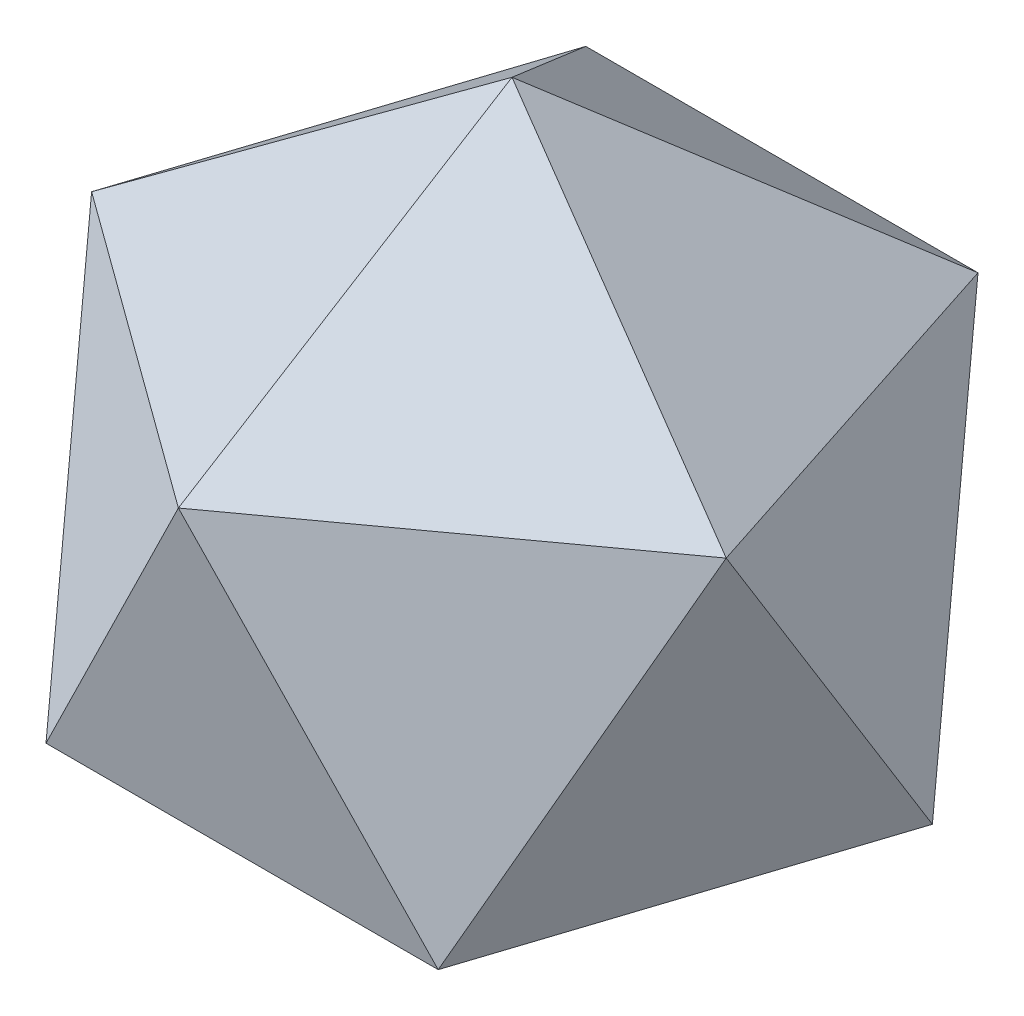
ISO-10303-21;
HEADER;
FILE_DESCRIPTION(('STEP AP214'),'2;1');
FILE_NAME('part.step','',(''),(''),'','','');
FILE_SCHEMA(('AUTOMOTIVE_DESIGN { 1 0 10303 214 1 1 1 1 }'));
ENDSEC;
DATA;
#1=APPLICATION_CONTEXT('core data for automotive mechanical design processes');
#2=APPLICATION_PROTOCOL_DEFINITION('international standard','automotive_design',2000,#1);
#3=PRODUCT_CONTEXT('',#1,'mechanical');
#4=PRODUCT('Part','Part','',(#3));
#5=PRODUCT_RELATED_PRODUCT_CATEGORY('part','',(#4));
#6=PRODUCT_DEFINITION_FORMATION('','',#4);
#7=PRODUCT_DEFINITION_CONTEXT('part definition',#1,'design');
#8=PRODUCT_DEFINITION('design','',#6,#7);
#9=PRODUCT_DEFINITION_SHAPE('','',#8);
#10=(LENGTH_UNIT() NAMED_UNIT(*) SI_UNIT(.MILLI.,.METRE.));
#11=(NAMED_UNIT(*) PLANE_ANGLE_UNIT() SI_UNIT($,.RADIAN.));
#12=(NAMED_UNIT(*) SI_UNIT($,.STERADIAN.) SOLID_ANGLE_UNIT());
#13=UNCERTAINTY_MEASURE_WITH_UNIT(LENGTH_MEASURE(1.E-05),#10,'distance_accuracy_value','');
#14=(GEOMETRIC_REPRESENTATION_CONTEXT(3) GLOBAL_UNCERTAINTY_ASSIGNED_CONTEXT((#13)) GLOBAL_UNIT_ASSIGNED_CONTEXT((#10,
#11,#12)) REPRESENTATION_CONTEXT('',''));
#15=CARTESIAN_POINT('',(0.,0.,0.));
#16=DIRECTION('',(0.,0.,1.));
#17=DIRECTION('',(1.,0.,0.));
#18=AXIS2_PLACEMENT_3D('',#15,#16,#17);
#19=CARTESIAN_POINT('',(-10.2589451239174,-3.33333333333333,-14.1202265916661));
#20=DIRECTION('',(0.577350269189618,0.187592474085079,0.794654472291772));
#21=DIRECTION('',(0.809016994374954,0.,-0.587785252292465));
#22=AXIS2_PLACEMENT_3D('',#19,#20,#21);
#23=PLANE('',#22);
#24=DIRECTION('',(0.809016994374954,0.,-0.587785252292465));
#25=VECTOR('',#24,1.);
#26=CARTESIAN_POINT('',(2.28983498828939E-13,0.,-22.3606797749979));
#27=LINE('',#26,#25);
#28=CARTESIAN_POINT('',(-21.266270208801,0.,-6.90983005625071));
#29=VERTEX_POINT('',#28);
#30=CARTESIAN_POINT('',(0.,0.,-22.3606797749979));
#31=VERTEX_POINT('',#30);
#32=EDGE_CURVE('E138',#29,#31,#27,.T.);
#33=ORIENTED_EDGE('',*,*,#32,.F.);
#34=DIRECTION('',(0.309016994374952,0.85065080835204,-0.425325404176017));
#35=VECTOR('',#34,1.);
#36=CARTESIAN_POINT('',(-13.1432778029782,22.3606797749979,-18.0901699437496));
#37=LINE('',#36,#35);
#38=CARTESIAN_POINT('',(-13.1432778029782,22.3606797749979,-18.0901699437496));
#39=VERTEX_POINT('',#38);
#40=EDGE_CURVE('E145',#29,#39,#37,.T.);
#41=ORIENTED_EDGE('',*,*,#40,.T.);
#42=DIRECTION('',(0.500000000000002,-0.85065080835204,-0.162459848116448));
#43=VECTOR('',#42,1.);
#44=CARTESIAN_POINT('',(-13.1432778029781,22.3606797749979,-18.0901699437496));
#45=LINE('',#44,#43);
#46=EDGE_CURVE('E156',#39,#31,#45,.T.);
#47=ORIENTED_EDGE('',*,*,#46,.T.);
#48=EDGE_LOOP('',(#33,#41,#47));
#49=FACE_BOUND('',#48,.T.);
#50=ADVANCED_FACE('F85',(#49),#23,.F.);
#51=CARTESIAN_POINT('',(-3.91856834861644,-8.72677996249966,-5.39344662916636));
#52=DIRECTION('',(0.356822089773085,0.794654472291766,0.491123473188427));
#53=DIRECTION('',(0.809016994374944,-0.525731112119134,0.262865556059576));
#54=AXIS2_PLACEMENT_3D('',#51,#52,#53);
#55=PLANE('',#54);
#56=DIRECTION('',(0.809016994374945,-0.525731112119134,0.262865556059573));
#57=VECTOR('',#56,1.);
#58=CARTESIAN_POINT('',(-21.266270208801,0.,-6.90983005625069));
#59=LINE('',#58,#57);
#60=CARTESIAN_POINT('',(0.,-13.8196601125011,0.));
#61=VERTEX_POINT('',#60);
#62=EDGE_CURVE('E155',#29,#61,#59,.T.);
#63=ORIENTED_EDGE('',*,*,#62,.F.);
#64=ORIENTED_EDGE('',*,*,#32,.T.);
#65=DIRECTION('',(0.,0.525731112119134,-0.85065080835204));
#66=VECTOR('',#65,1.);
#67=CARTESIAN_POINT('',(0.,0.,-22.3606797749979));
#68=LINE('',#67,#66);
#69=EDGE_CURVE('E161',#61,#31,#68,.T.);
#70=ORIENTED_EDGE('',*,*,#69,.F.);
#71=EDGE_LOOP('',(#63,#64,#70));
#72=FACE_BOUND('',#71,.T.);
#73=ADVANCED_FACE('F160',(#72),#55,.F.);
#74=CARTESIAN_POINT('',(2.51534904016637E-13,4.12022659166599,-21.5737865166653));
#75=DIRECTION('',(0.,0.187592474085081,-0.982246946376846));
#76=DIRECTION('',(-1.,0.,0.));
#77=AXIS2_PLACEMENT_3D('',#74,#75,#76);
#78=PLANE('',#77);
#79=DIRECTION('',(-0.5,-0.85065080835204,-0.162459848116453));
#80=VECTOR('',#79,1.);
#81=CARTESIAN_POINT('',(13.1432778029783,22.3606797749979,-18.0901699437495));
#82=LINE('',#81,#80);
#83=CARTESIAN_POINT('',(13.1432778029784,22.3606797749979,-18.0901699437495));
#84=VERTEX_POINT('',#83);
#85=EDGE_CURVE('E272',#84,#31,#82,.T.);
#86=ORIENTED_EDGE('',*,*,#85,.T.);
#87=ORIENTED_EDGE('',*,*,#46,.F.);
#88=DIRECTION('',(-1.,0.,0.));
#89=VECTOR('',#88,1.);
#90=CARTESIAN_POINT('',(13.1432778029785,22.3606797749979,-18.0901699437493));
#91=LINE('',#90,#89);
#92=EDGE_CURVE('E259',#84,#39,#91,.T.);
#93=ORIENTED_EDGE('',*,*,#92,.F.);
#94=EDGE_LOOP('',(#86,#87,#93));
#95=FACE_BOUND('',#94,.T.);
#96=ADVANCED_FACE('F419',(#95),#78,.T.);
#97=CARTESIAN_POINT('',(-20.517890247835,4.12022659166599,-6.66666666666686));
#98=DIRECTION('',(-0.934172358962713,0.187592474085081,-0.303530999103352));
#99=DIRECTION('',(-0.309016994374956,0.,0.951056516295151));
#100=AXIS2_PLACEMENT_3D('',#97,#98,#99);
#101=PLANE('',#100);
#102=ORIENTED_EDGE('',*,*,#40,.F.);
#103=DIRECTION('',(0.,0.85065080835204,0.525731112119133));
#104=VECTOR('',#103,1.);
#105=CARTESIAN_POINT('',(-21.2662702088011,22.3606797749979,6.90983005625035));
#106=LINE('',#105,#104);
#107=CARTESIAN_POINT('',(-21.266270208801,22.3606797749979,6.90983005625039));
#108=VERTEX_POINT('',#107);
#109=EDGE_CURVE('E148',#29,#108,#106,.T.);
#110=ORIENTED_EDGE('',*,*,#109,.T.);
#111=DIRECTION('',(-0.309016994374956,0.,0.951056516295151));
#112=VECTOR('',#111,1.);
#113=CARTESIAN_POINT('',(-13.1432778029782,22.3606797749979,-18.0901699437496));
#114=LINE('',#113,#112);
#115=EDGE_CURVE('E150',#39,#108,#114,.T.);
#116=ORIENTED_EDGE('',*,*,#115,.F.);
#117=EDGE_LOOP('',(#102,#110,#116));
#118=FACE_BOUND('',#117,.T.);
#119=ADVANCED_FACE('F146',(#118),#101,.T.);
#120=CARTESIAN_POINT('',(-6.34037677530105,-8.72677996249966,2.06011329583294));
#121=DIRECTION('',(0.577350269189627,0.794654472291766,-0.187592474085075));
#122=DIRECTION('',(0.500000000000006,-0.525731112119134,-0.688190960235582));
#123=AXIS2_PLACEMENT_3D('',#120,#121,#122);
#124=PLANE('',#123);
#125=DIRECTION('',(0.500000000000003,-0.525731112119133,-0.688190960235584));
#126=VECTOR('',#125,1.);
#127=CARTESIAN_POINT('',(-13.1432778029784,0.,18.0901699437494));
#128=LINE('',#127,#126);
#129=CARTESIAN_POINT('',(-13.1432778029784,0.,18.0901699437494));
#130=VERTEX_POINT('',#129);
#131=EDGE_CURVE('E177',#130,#61,#128,.T.);
#132=ORIENTED_EDGE('',*,*,#131,.F.);
#133=DIRECTION('',(-0.30901699437494,0.,-0.951056516295156));
#134=VECTOR('',#133,1.);
#135=CARTESIAN_POINT('',(-21.266270208801,0.,-6.9098300562507));
#136=LINE('',#135,#134);
#137=EDGE_CURVE('E168',#130,#29,#136,.T.);
#138=ORIENTED_EDGE('',*,*,#137,.T.);
#139=ORIENTED_EDGE('',*,*,#62,.T.);
#140=EDGE_LOOP('',(#132,#138,#139));
#141=FACE_BOUND('',#140,.T.);
#142=ADVANCED_FACE('F176',(#141),#124,.F.);
#143=CARTESIAN_POINT('',(-16.5993218992186,-3.33333333333333,5.39344662916619));
#144=DIRECTION('',(0.934172358962718,0.18759247408508,-0.303530999103336));
#145=DIRECTION('',(-0.30901699437494,0.,-0.951056516295156));
#146=AXIS2_PLACEMENT_3D('',#143,#144,#145);
#147=PLANE('',#146);
#148=ORIENTED_EDGE('',*,*,#137,.F.);
#149=DIRECTION('',(-0.309016994374945,0.85065080835204,-0.425325404176022));
#150=VECTOR('',#149,1.);
#151=CARTESIAN_POINT('',(-21.266270208801,22.3606797749979,6.90983005625043));
#152=LINE('',#151,#150);
#153=EDGE_CURVE('E173',#130,#108,#152,.T.);
#154=ORIENTED_EDGE('',*,*,#153,.T.);
#155=ORIENTED_EDGE('',*,*,#109,.F.);
#156=EDGE_LOOP('',(#148,#154,#155));
#157=FACE_BOUND('',#156,.T.);
#158=ADVANCED_FACE('F171',(#157),#147,.F.);
#159=CARTESIAN_POINT('',(3.91856834861649,-8.72677996249966,-5.39344662916633));
#160=DIRECTION('',(-0.356822089773089,0.794654472291766,0.491123473188424));
#161=DIRECTION('',(0.,-0.525731112119134,0.85065080835204));
#162=AXIS2_PLACEMENT_3D('',#159,#160,#161);
#163=PLANE('',#162);
#164=ORIENTED_EDGE('',*,*,#69,.T.);
#165=DIRECTION('',(0.809016994374948,0.,0.587785252292472));
#166=VECTOR('',#165,1.);
#167=CARTESIAN_POINT('',(21.266270208801,0.,-6.90983005625055));
#168=LINE('',#167,#166);
#169=CARTESIAN_POINT('',(21.266270208801,0.,-6.90983005625051));
#170=VERTEX_POINT('',#169);
#171=EDGE_CURVE('E210',#31,#170,#168,.T.);
#172=ORIENTED_EDGE('',*,*,#171,.T.);
#173=DIRECTION('',(0.809016994374948,0.525731112119134,-0.262865556059565));
#174=VECTOR('',#173,1.);
#175=CARTESIAN_POINT('',(21.266270208801,0.,-6.90983005625049));
#176=LINE('',#175,#174);
#177=EDGE_CURVE('E312',#61,#170,#176,.T.);
#178=ORIENTED_EDGE('',*,*,#177,.F.);
#179=EDGE_LOOP('',(#164,#172,#178));
#180=FACE_BOUND('',#179,.T.);
#181=ADVANCED_FACE('F532',(#180),#163,.F.);
#182=CARTESIAN_POINT('',(10.2589451239175,-3.33333333333333,-14.120226591666));
#183=DIRECTION('',(-0.577350269189625,0.18759247408508,0.794654472291767));
#184=DIRECTION('',(0.809016994374948,0.,0.587785252292472));
#185=AXIS2_PLACEMENT_3D('',#182,#183,#184);
#186=PLANE('',#185);
#187=ORIENTED_EDGE('',*,*,#171,.F.);
#188=ORIENTED_EDGE('',*,*,#85,.F.);
#189=DIRECTION('',(0.309016994374948,-0.85065080835204,0.42532540417602));
#190=VECTOR('',#189,1.);
#191=CARTESIAN_POINT('',(13.1432778029784,22.3606797749979,-18.0901699437495));
#192=LINE('',#191,#190);
#193=EDGE_CURVE('E318',#84,#170,#192,.T.);
#194=ORIENTED_EDGE('',*,*,#193,.T.);
#195=EDGE_LOOP('',(#187,#188,#194));
#196=FACE_BOUND('',#195,.T.);
#197=ADVANCED_FACE('F523',(#196),#186,.F.);
#198=CARTESIAN_POINT('',(2.02962646689286E-13,22.8470065541656,-17.4535599249993));
#199=DIRECTION('',(0.,0.794654472291766,-0.607061998206687));
#200=DIRECTION('',(-0.250000000000009,0.587785252292474,0.76942088429381));
#201=AXIS2_PLACEMENT_3D('',#198,#199,#200);
#202=PLANE('',#201);
#203=ORIENTED_EDGE('',*,*,#92,.T.);
#204=DIRECTION('',(-0.499999999999994,-0.525731112119134,-0.688190960235591));
#205=VECTOR('',#204,1.);
#206=CARTESIAN_POINT('',(0.,36.180339887499,0.));
#207=LINE('',#206,#205);
#208=CARTESIAN_POINT('',(0.,36.180339887499,0.));
#209=VERTEX_POINT('',#208);
#210=EDGE_CURVE('E250',#209,#39,#207,.T.);
#211=ORIENTED_EDGE('',*,*,#210,.F.);
#212=DIRECTION('',(-0.499999999999999,0.525731112119134,0.688190960235587));
#213=VECTOR('',#212,1.);
#214=CARTESIAN_POINT('',(0.,36.180339887499,0.));
#215=LINE('',#214,#213);
#216=EDGE_CURVE('E331',#84,#209,#215,.T.);
#217=ORIENTED_EDGE('',*,*,#216,.F.);
#218=EDGE_LOOP('',(#203,#211,#217));
#219=FACE_BOUND('',#218,.T.);
#220=ADVANCED_FACE('F421',(#219),#202,.T.);
#221=CARTESIAN_POINT('',(-16.5993218992185,22.8470065541656,-5.39344662916647));
#222=DIRECTION('',(-0.577350269189625,0.794654472291766,-0.187592474085085));
#223=DIRECTION('',(0.654508497187469,0.587785252292474,0.475528258147582));
#224=AXIS2_PLACEMENT_3D('',#221,#222,#223);
#225=PLANE('',#224);
#226=ORIENTED_EDGE('',*,*,#115,.T.);
#227=DIRECTION('',(-0.809016994374948,-0.525731112119134,0.262865556059562));
#228=VECTOR('',#227,1.);
#229=CARTESIAN_POINT('',(0.,36.180339887499,0.));
#230=LINE('',#229,#228);
#231=EDGE_CURVE('E341',#209,#108,#230,.T.);
#232=ORIENTED_EDGE('',*,*,#231,.F.);
#233=ORIENTED_EDGE('',*,*,#210,.T.);
#234=EDGE_LOOP('',(#226,#232,#233));
#235=FACE_BOUND('',#234,.T.);
#236=ADVANCED_FACE('F426',(#235),#225,.T.);
#237=CARTESIAN_POINT('',(0.,-8.72677996249966,6.66666666666667));
#238=DIRECTION('',(0.,0.794654472291766,-0.607061998206686));
#239=DIRECTION('',(-0.499999999999996,-0.525731112119134,-0.68819096023559));
#240=AXIS2_PLACEMENT_3D('',#237,#238,#239);
#241=PLANE('',#240);
#242=DIRECTION('',(-0.499999999999999,-0.525731112119134,-0.688190960235588));
#243=VECTOR('',#242,1.);
#244=CARTESIAN_POINT('',(13.1432778029783,0.,18.0901699437495));
#245=LINE('',#244,#243);
#246=CARTESIAN_POINT('',(13.1432778029783,0.,18.0901699437495));
#247=VERTEX_POINT('',#246);
#248=EDGE_CURVE('E315',#247,#61,#245,.T.);
#249=ORIENTED_EDGE('',*,*,#248,.F.);
#250=DIRECTION('',(-1.,0.,0.));
#251=VECTOR('',#250,1.);
#252=CARTESIAN_POINT('',(-13.1432778029784,0.,18.0901699437494));
#253=LINE('',#252,#251);
#254=EDGE_CURVE('E344',#247,#130,#253,.T.);
#255=ORIENTED_EDGE('',*,*,#254,.T.);
#256=ORIENTED_EDGE('',*,*,#131,.T.);
#257=EDGE_LOOP('',(#249,#255,#256));
#258=FACE_BOUND('',#257,.T.);
#259=ADVANCED_FACE('F499',(#258),#241,.F.);
#260=CARTESIAN_POINT('',(-12.6807535506022,4.12022659166599,17.4535599249993));
#261=DIRECTION('',(-0.577350269189631,0.187592474085081,0.794654472291763));
#262=DIRECTION('',(0.809016994374944,0.,0.587785252292478));
#263=AXIS2_PLACEMENT_3D('',#260,#261,#262);
#264=PLANE('',#263);
#265=ORIENTED_EDGE('',*,*,#153,.F.);
#266=DIRECTION('',(0.499999999999999,0.85065080835204,0.162459848116455));
#267=VECTOR('',#266,1.);
#268=CARTESIAN_POINT('',(-1.16226472890446E-13,22.3606797749979,22.3606797749979));
#269=LINE('',#268,#267);
#270=CARTESIAN_POINT('',(0.,22.3606797749979,22.3606797749979));
#271=VERTEX_POINT('',#270);
#272=EDGE_CURVE('E351',#130,#271,#269,.T.);
#273=ORIENTED_EDGE('',*,*,#272,.T.);
#274=DIRECTION('',(0.809016994374944,0.,0.587785252292478));
#275=VECTOR('',#274,1.);
#276=CARTESIAN_POINT('',(-21.266270208801,22.3606797749979,6.90983005625042));
#277=LINE('',#276,#275);
#278=EDGE_CURVE('E104',#108,#271,#277,.T.);
#279=ORIENTED_EDGE('',*,*,#278,.F.);
#280=EDGE_LOOP('',(#265,#273,#279));
#281=FACE_BOUND('',#280,.T.);
#282=ADVANCED_FACE('F492',(#281),#264,.T.);
#283=CARTESIAN_POINT('',(6.34037677530103,-8.72677996249966,2.060113295833));
#284=DIRECTION('',(-0.577350269189626,0.794654472291766,-0.187592474085081));
#285=DIRECTION('',(-0.809016994374948,-0.525731112119134,0.262865556059564));
#286=AXIS2_PLACEMENT_3D('',#283,#284,#285);
#287=PLANE('',#286);
#288=ORIENTED_EDGE('',*,*,#177,.T.);
#289=DIRECTION('',(-0.309016994374949,0.,0.951056516295153));
#290=VECTOR('',#289,1.);
#291=CARTESIAN_POINT('',(13.1432778029783,0.,18.0901699437495));
#292=LINE('',#291,#290);
#293=EDGE_CURVE('E355',#170,#247,#292,.T.);
#294=ORIENTED_EDGE('',*,*,#293,.T.);
#295=ORIENTED_EDGE('',*,*,#248,.T.);
#296=EDGE_LOOP('',(#288,#294,#295));
#297=FACE_BOUND('',#296,.T.);
#298=ADVANCED_FACE('F406',(#297),#287,.F.);
#299=CARTESIAN_POINT('',(20.5178902478351,4.12022659166599,-6.66666666666667));
#300=DIRECTION('',(0.934172358962716,0.187592474085081,-0.303530999103343));
#301=DIRECTION('',(-0.309016994374947,0.,-0.951056516295154));
#302=AXIS2_PLACEMENT_3D('',#299,#300,#301);
#303=PLANE('',#302);
#304=DIRECTION('',(0.,-0.85065080835204,-0.525731112119134));
#305=VECTOR('',#304,1.);
#306=CARTESIAN_POINT('',(21.266270208801,22.3606797749979,6.90983005625058));
#307=LINE('',#306,#305);
#308=CARTESIAN_POINT('',(21.266270208801,22.3606797749979,6.90983005625058));
#309=VERTEX_POINT('',#308);
#310=EDGE_CURVE('E363',#309,#170,#307,.T.);
#311=ORIENTED_EDGE('',*,*,#310,.T.);
#312=ORIENTED_EDGE('',*,*,#193,.F.);
#313=DIRECTION('',(-0.309016994374948,0.,-0.951056516295154));
#314=VECTOR('',#313,1.);
#315=CARTESIAN_POINT('',(21.266270208801,22.3606797749979,6.90983005625051));
#316=LINE('',#315,#314);
#317=EDGE_CURVE('E328',#309,#84,#316,.T.);
#318=ORIENTED_EDGE('',*,*,#317,.F.);
#319=EDGE_LOOP('',(#311,#312,#318));
#320=FACE_BOUND('',#319,.T.);
#321=ADVANCED_FACE('F412',(#320),#303,.T.);
#322=CARTESIAN_POINT('',(16.5993218992186,22.8470065541656,-5.39344662916632));
#323=DIRECTION('',(0.577350269189627,0.794654472291766,-0.18759247408508));
#324=DIRECTION('',(-0.809016994374947,0.587785252292474,0.));
#325=AXIS2_PLACEMENT_3D('',#322,#323,#324);
#326=PLANE('',#325);
#327=ORIENTED_EDGE('',*,*,#317,.T.);
#328=ORIENTED_EDGE('',*,*,#216,.T.);
#329=DIRECTION('',(-0.809016994374947,0.525731112119134,-0.262865556059569));
#330=VECTOR('',#329,1.);
#331=CARTESIAN_POINT('',(0.,36.180339887499,0.));
#332=LINE('',#331,#330);
#333=EDGE_CURVE('E367',#309,#209,#332,.T.);
#334=ORIENTED_EDGE('',*,*,#333,.F.);
#335=EDGE_LOOP('',(#327,#328,#334));
#336=FACE_BOUND('',#335,.T.);
#337=ADVANCED_FACE('F415',(#336),#326,.T.);
#338=CARTESIAN_POINT('',(-10.2589451239176,22.8470065541656,14.1202265916659));
#339=DIRECTION('',(-0.356822089773093,0.794654472291766,0.491123473188422));
#340=DIRECTION('',(0.654508497187476,0.587785252292474,-0.475528258147573));
#341=AXIS2_PLACEMENT_3D('',#338,#339,#340);
#342=PLANE('',#341);
#343=ORIENTED_EDGE('',*,*,#278,.T.);
#344=DIRECTION('',(0.,-0.525731112119135,0.85065080835204));
#345=VECTOR('',#344,1.);
#346=CARTESIAN_POINT('',(0.,36.180339887499,0.));
#347=LINE('',#346,#345);
#348=EDGE_CURVE('E375',#209,#271,#347,.T.);
#349=ORIENTED_EDGE('',*,*,#348,.F.);
#350=ORIENTED_EDGE('',*,*,#231,.T.);
#351=EDGE_LOOP('',(#343,#349,#350));
#352=FACE_BOUND('',#351,.T.);
#353=ADVANCED_FACE('F427',(#352),#342,.T.);
#354=CARTESIAN_POINT('',(0.,-3.33333333333333,17.4535599249993));
#355=DIRECTION('',(0.,0.18759247408508,-0.982246946376846));
#356=DIRECTION('',(-1.,0.,0.));
#357=AXIS2_PLACEMENT_3D('',#354,#355,#356);
#358=PLANE('',#357);
#359=ORIENTED_EDGE('',*,*,#254,.F.);
#360=DIRECTION('',(-0.500000000000001,0.85065080835204,0.162459848116451));
#361=VECTOR('',#360,1.);
#362=CARTESIAN_POINT('',(0.,22.3606797749979,22.3606797749979));
#363=LINE('',#362,#361);
#364=EDGE_CURVE('E378',#247,#271,#363,.T.);
#365=ORIENTED_EDGE('',*,*,#364,.T.);
#366=ORIENTED_EDGE('',*,*,#272,.F.);
#367=EDGE_LOOP('',(#359,#365,#366));
#368=FACE_BOUND('',#367,.T.);
#369=ADVANCED_FACE('F398',(#368),#358,.F.);
#370=CARTESIAN_POINT('',(16.5993218992185,-3.33333333333333,5.39344662916636));
#371=DIRECTION('',(-0.934172358962715,0.18759247408508,-0.303530999103345));
#372=DIRECTION('',(-0.309016994374949,0.,0.951056516295153));
#373=AXIS2_PLACEMENT_3D('',#370,#371,#372);
#374=PLANE('',#373);
#375=ORIENTED_EDGE('',*,*,#293,.F.);
#376=ORIENTED_EDGE('',*,*,#310,.F.);
#377=DIRECTION('',(-0.309016994374948,-0.85065080835204,0.42532540417602));
#378=VECTOR('',#377,1.);
#379=CARTESIAN_POINT('',(21.266270208801,22.3606797749979,6.9098300562506));
#380=LINE('',#379,#378);
#381=EDGE_CURVE('E95',#309,#247,#380,.T.);
#382=ORIENTED_EDGE('',*,*,#381,.T.);
#383=EDGE_LOOP('',(#375,#376,#382));
#384=FACE_BOUND('',#383,.T.);
#385=ADVANCED_FACE('F408',(#384),#374,.F.);
#386=CARTESIAN_POINT('',(10.2589451239175,22.8470065541656,14.120226591666));
#387=DIRECTION('',(0.356822089773089,0.794654472291766,0.491123473188425));
#388=DIRECTION('',(-0.249999999999998,0.587785252292474,-0.769420884293814));
#389=AXIS2_PLACEMENT_3D('',#386,#387,#388);
#390=PLANE('',#389);
#391=DIRECTION('',(0.80901699437495,0.,-0.587785252292471));
#392=VECTOR('',#391,1.);
#393=CARTESIAN_POINT('',(0.,22.3606797749979,22.3606797749979));
#394=LINE('',#393,#392);
#395=EDGE_CURVE('E13',#271,#309,#394,.T.);
#396=ORIENTED_EDGE('',*,*,#395,.T.);
#397=ORIENTED_EDGE('',*,*,#333,.T.);
#398=ORIENTED_EDGE('',*,*,#348,.T.);
#399=EDGE_LOOP('',(#396,#397,#398));
#400=FACE_BOUND('',#399,.T.);
#401=ADVANCED_FACE('F425',(#400),#390,.T.);
#402=CARTESIAN_POINT('',(12.680753550602,4.12022659166599,17.4535599249994));
#403=DIRECTION('',(0.577350269189623,0.187592474085081,0.794654472291768));
#404=DIRECTION('',(0.809016994374949,0.,-0.587785252292471));
#405=AXIS2_PLACEMENT_3D('',#402,#403,#404);
#406=PLANE('',#405);
#407=ORIENTED_EDGE('',*,*,#364,.F.);
#408=ORIENTED_EDGE('',*,*,#381,.F.);
#409=ORIENTED_EDGE('',*,*,#395,.F.);
#410=EDGE_LOOP('',(#407,#408,#409));
#411=FACE_BOUND('',#410,.T.);
#412=ADVANCED_FACE('F403',(#411),#406,.T.);
#413=CLOSED_SHELL('',(#50,#73,#96,#119,#142,#158,#181,#197,#220,#236,#259,#282,#298,#321,#337,
#353,#369,#385,#401,#412));
#414=MANIFOLD_SOLID_BREP('B2',#413);
#415=ADVANCED_BREP_SHAPE_REPRESENTATION('',(#18,#414),#14);
#416=SHAPE_DEFINITION_REPRESENTATION(#9,#415);
ENDSEC;
END-ISO-10303-21;
